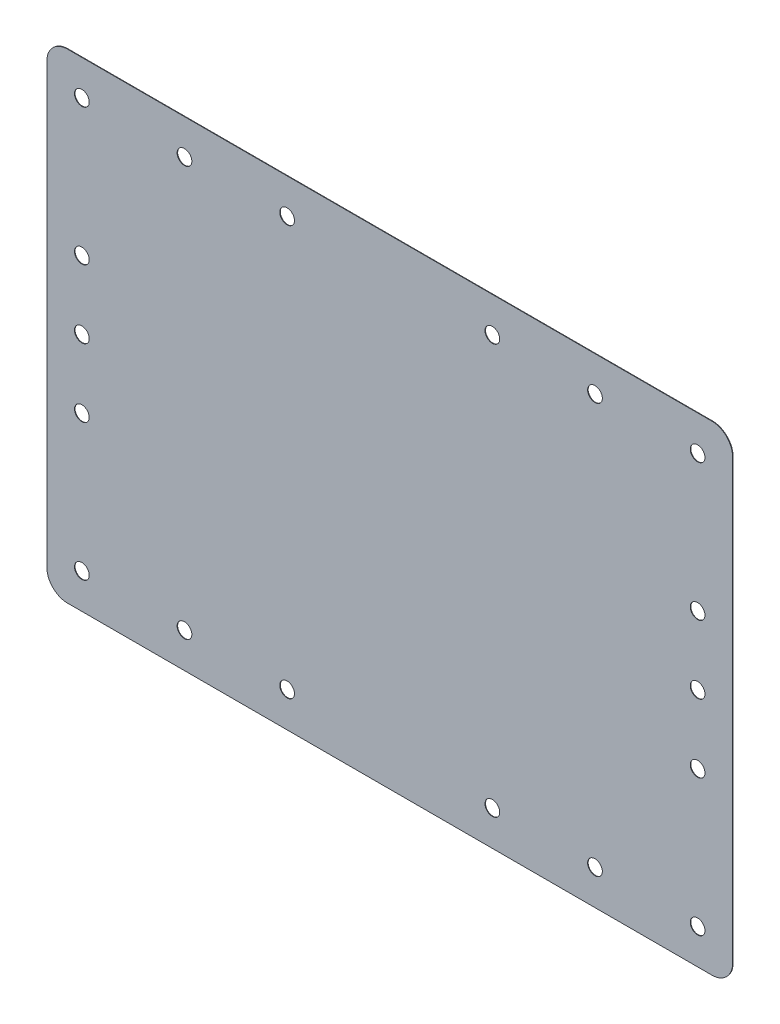
ISO-10303-21;
HEADER;
FILE_DESCRIPTION(('STEP AP214'),'2;1');
FILE_NAME('part.step','',(''),(''),'','','');
FILE_SCHEMA(('AUTOMOTIVE_DESIGN { 1 0 10303 214 1 1 1 1 }'));
ENDSEC;
DATA;
#1=APPLICATION_CONTEXT('core data for automotive mechanical design processes');
#2=APPLICATION_PROTOCOL_DEFINITION('international standard','automotive_design',2000,#1);
#3=PRODUCT_CONTEXT('',#1,'mechanical');
#4=PRODUCT('Part','Part','',(#3));
#5=PRODUCT_RELATED_PRODUCT_CATEGORY('part','',(#4));
#6=PRODUCT_DEFINITION_FORMATION('','',#4);
#7=PRODUCT_DEFINITION_CONTEXT('part definition',#1,'design');
#8=PRODUCT_DEFINITION('design','',#6,#7);
#9=PRODUCT_DEFINITION_SHAPE('','',#8);
#10=(LENGTH_UNIT() NAMED_UNIT(*) SI_UNIT(.MILLI.,.METRE.));
#11=(NAMED_UNIT(*) PLANE_ANGLE_UNIT() SI_UNIT($,.RADIAN.));
#12=(NAMED_UNIT(*) SI_UNIT($,.STERADIAN.) SOLID_ANGLE_UNIT());
#13=UNCERTAINTY_MEASURE_WITH_UNIT(LENGTH_MEASURE(1.E-05),#10,'distance_accuracy_value','');
#14=(GEOMETRIC_REPRESENTATION_CONTEXT(3) GLOBAL_UNCERTAINTY_ASSIGNED_CONTEXT((#13)) GLOBAL_UNIT_ASSIGNED_CONTEXT((#10,
#11,#12)) REPRESENTATION_CONTEXT('',''));
#15=CARTESIAN_POINT('',(0.,0.,0.));
#16=DIRECTION('',(0.,0.,1.));
#17=DIRECTION('',(1.,0.,0.));
#18=AXIS2_PLACEMENT_3D('',#15,#16,#17);
#19=CARTESIAN_POINT('',(82.8071242188,0.,0.127));
#20=DIRECTION('',(-1.,0.,0.));
#21=DIRECTION('',(0.,0.,1.));
#22=AXIS2_PLACEMENT_3D('',#19,#20,#21);
#23=PLANE('',#22);
#24=DIRECTION('',(0.,1.,0.));
#25=VECTOR('',#24,1.);
#26=CARTESIAN_POINT('',(82.8071242188,0.,0.));
#27=LINE('',#26,#25);
#28=CARTESIAN_POINT('',(82.8071242188,-52.938976545,0.));
#29=VERTEX_POINT('',#28);
#30=CARTESIAN_POINT('',(82.8071242188,52.938976545,0.));
#31=VERTEX_POINT('',#30);
#32=EDGE_CURVE('E245',#29,#31,#27,.T.);
#33=ORIENTED_EDGE('',*,*,#32,.T.);
#34=DIRECTION('',(0.,0.,-1.));
#35=VECTOR('',#34,1.);
#36=CARTESIAN_POINT('',(82.8071242188,52.938976545,0.127));
#37=LINE('',#36,#35);
#38=CARTESIAN_POINT('',(82.8071242188,52.938976545,0.127));
#39=VERTEX_POINT('',#38);
#40=EDGE_CURVE('E13',#39,#31,#37,.T.);
#41=ORIENTED_EDGE('',*,*,#40,.F.);
#42=DIRECTION('',(0.,1.,0.));
#43=VECTOR('',#42,1.);
#44=CARTESIAN_POINT('',(82.8071242188,0.,0.127));
#45=LINE('',#44,#43);
#46=CARTESIAN_POINT('',(82.8071242188,-52.938976545,0.127));
#47=VERTEX_POINT('',#46);
#48=EDGE_CURVE('E308',#47,#39,#45,.T.);
#49=ORIENTED_EDGE('',*,*,#48,.F.);
#50=DIRECTION('',(0.,0.,-1.));
#51=VECTOR('',#50,1.);
#52=CARTESIAN_POINT('',(82.8071242188,-52.938976545,0.127));
#53=LINE('',#52,#51);
#54=EDGE_CURVE('E170',#47,#29,#53,.T.);
#55=ORIENTED_EDGE('',*,*,#54,.T.);
#56=EDGE_LOOP('',(#33,#41,#49,#55));
#57=FACE_BOUND('',#56,.T.);
#58=ADVANCED_FACE('F54',(#57),#23,.F.);
#59=CARTESIAN_POINT('',(77.8133207404905,52.9383207404905,0.127));
#60=DIRECTION('',(0.,0.,-1.));
#61=DIRECTION('',(-1.,0.,0.));
#62=AXIS2_PLACEMENT_3D('',#59,#60,#61);
#63=CYLINDRICAL_SURFACE('',#62,4.99380352137079);
#64=CARTESIAN_POINT('',(77.8133207404905,52.9383207404905,0.));
#65=DIRECTION('',(0.,0.,1.));
#66=DIRECTION('',(1.,0.,0.));
#67=AXIS2_PLACEMENT_3D('',#64,#65,#66);
#68=CIRCLE('',#67,4.99380352137079);
#69=CARTESIAN_POINT('',(77.813976545,57.9321242188,0.));
#70=VERTEX_POINT('',#69);
#71=EDGE_CURVE('E249',#31,#70,#68,.T.);
#72=ORIENTED_EDGE('',*,*,#71,.T.);
#73=DIRECTION('',(0.,0.,-1.));
#74=VECTOR('',#73,1.);
#75=CARTESIAN_POINT('',(77.813976545,57.9321242188,0.127));
#76=LINE('',#75,#74);
#77=CARTESIAN_POINT('',(77.813976545,57.9321242188,0.127));
#78=VERTEX_POINT('',#77);
#79=EDGE_CURVE('E64',#78,#70,#76,.T.);
#80=ORIENTED_EDGE('',*,*,#79,.F.);
#81=CARTESIAN_POINT('',(77.8133207404905,52.9383207404905,0.127));
#82=DIRECTION('',(0.,0.,1.));
#83=DIRECTION('',(1.,0.,0.));
#84=AXIS2_PLACEMENT_3D('',#81,#82,#83);
#85=CIRCLE('',#84,4.99380352137079);
#86=EDGE_CURVE('E126',#39,#78,#85,.T.);
#87=ORIENTED_EDGE('',*,*,#86,.F.);
#88=ORIENTED_EDGE('',*,*,#40,.T.);
#89=EDGE_LOOP('',(#72,#80,#87,#88));
#90=FACE_BOUND('',#89,.T.);
#91=ADVANCED_FACE('F438',(#90),#63,.T.);
#92=CARTESIAN_POINT('',(0.,57.9321242188,0.127));
#93=DIRECTION('',(0.,-1.,0.));
#94=DIRECTION('',(0.,0.,-1.));
#95=AXIS2_PLACEMENT_3D('',#92,#93,#94);
#96=PLANE('',#95);
#97=DIRECTION('',(-1.,0.,0.));
#98=VECTOR('',#97,1.);
#99=CARTESIAN_POINT('',(0.,57.9321242188,0.));
#100=LINE('',#99,#98);
#101=CARTESIAN_POINT('',(-77.813976545,57.9321242188,0.));
#102=VERTEX_POINT('',#101);
#103=EDGE_CURVE('E252',#70,#102,#100,.T.);
#104=ORIENTED_EDGE('',*,*,#103,.T.);
#105=DIRECTION('',(0.,0.,-1.));
#106=VECTOR('',#105,1.);
#107=CARTESIAN_POINT('',(-77.813976545,57.9321242188,0.127));
#108=LINE('',#107,#106);
#109=CARTESIAN_POINT('',(-77.813976545,57.9321242188,0.127));
#110=VERTEX_POINT('',#109);
#111=EDGE_CURVE('E277',#110,#102,#108,.T.);
#112=ORIENTED_EDGE('',*,*,#111,.F.);
#113=DIRECTION('',(-1.,0.,0.));
#114=VECTOR('',#113,1.);
#115=CARTESIAN_POINT('',(0.,57.9321242188,0.127));
#116=LINE('',#115,#114);
#117=EDGE_CURVE('E287',#78,#110,#116,.T.);
#118=ORIENTED_EDGE('',*,*,#117,.F.);
#119=ORIENTED_EDGE('',*,*,#79,.T.);
#120=EDGE_LOOP('',(#104,#112,#118,#119));
#121=FACE_BOUND('',#120,.T.);
#122=ADVANCED_FACE('F285',(#121),#96,.F.);
#123=CARTESIAN_POINT('',(-77.8133207404905,52.9383207404905,0.127));
#124=DIRECTION('',(0.,0.,-1.));
#125=DIRECTION('',(-1.,0.,0.));
#126=AXIS2_PLACEMENT_3D('',#123,#124,#125);
#127=CYLINDRICAL_SURFACE('',#126,4.99380352137079);
#128=CARTESIAN_POINT('',(-77.8133207404905,52.9383207404905,0.));
#129=DIRECTION('',(0.,0.,1.));
#130=DIRECTION('',(1.,0.,0.));
#131=AXIS2_PLACEMENT_3D('',#128,#129,#130);
#132=CIRCLE('',#131,4.99380352137079);
#133=CARTESIAN_POINT('',(-82.8071242188,52.938976545,0.));
#134=VERTEX_POINT('',#133);
#135=EDGE_CURVE('E255',#102,#134,#132,.T.);
#136=ORIENTED_EDGE('',*,*,#135,.T.);
#137=DIRECTION('',(0.,0.,-1.));
#138=VECTOR('',#137,1.);
#139=CARTESIAN_POINT('',(-82.8071242188,52.938976545,0.127));
#140=LINE('',#139,#138);
#141=CARTESIAN_POINT('',(-82.8071242188,52.938976545,0.127));
#142=VERTEX_POINT('',#141);
#143=EDGE_CURVE('E273',#142,#134,#140,.T.);
#144=ORIENTED_EDGE('',*,*,#143,.F.);
#145=CARTESIAN_POINT('',(-77.8133207404905,52.9383207404905,0.127));
#146=DIRECTION('',(0.,0.,1.));
#147=DIRECTION('',(1.,0.,0.));
#148=AXIS2_PLACEMENT_3D('',#145,#146,#147);
#149=CIRCLE('',#148,4.99380352137079);
#150=EDGE_CURVE('E300',#110,#142,#149,.T.);
#151=ORIENTED_EDGE('',*,*,#150,.F.);
#152=ORIENTED_EDGE('',*,*,#111,.T.);
#153=EDGE_LOOP('',(#136,#144,#151,#152));
#154=FACE_BOUND('',#153,.T.);
#155=ADVANCED_FACE('F295',(#154),#127,.T.);
#156=CARTESIAN_POINT('',(-82.8071242188,0.,0.127));
#157=DIRECTION('',(1.,0.,0.));
#158=DIRECTION('',(0.,0.,-1.));
#159=AXIS2_PLACEMENT_3D('',#156,#157,#158);
#160=PLANE('',#159);
#161=DIRECTION('',(0.,-1.,0.));
#162=VECTOR('',#161,1.);
#163=CARTESIAN_POINT('',(-82.8071242188,0.,0.));
#164=LINE('',#163,#162);
#165=CARTESIAN_POINT('',(-82.8071242188,-52.938976545,0.));
#166=VERTEX_POINT('',#165);
#167=EDGE_CURVE('E258',#134,#166,#164,.T.);
#168=ORIENTED_EDGE('',*,*,#167,.T.);
#169=DIRECTION('',(0.,0.,-1.));
#170=VECTOR('',#169,1.);
#171=CARTESIAN_POINT('',(-82.8071242188,-52.938976545,0.127));
#172=LINE('',#171,#170);
#173=CARTESIAN_POINT('',(-82.8071242188,-52.938976545,0.127));
#174=VERTEX_POINT('',#173);
#175=EDGE_CURVE('E161',#174,#166,#172,.T.);
#176=ORIENTED_EDGE('',*,*,#175,.F.);
#177=DIRECTION('',(0.,-1.,0.));
#178=VECTOR('',#177,1.);
#179=CARTESIAN_POINT('',(-82.8071242188,0.,0.127));
#180=LINE('',#179,#178);
#181=EDGE_CURVE('E150',#142,#174,#180,.T.);
#182=ORIENTED_EDGE('',*,*,#181,.F.);
#183=ORIENTED_EDGE('',*,*,#143,.T.);
#184=EDGE_LOOP('',(#168,#176,#182,#183));
#185=FACE_BOUND('',#184,.T.);
#186=ADVANCED_FACE('F298',(#185),#160,.F.);
#187=CARTESIAN_POINT('',(-77.8133207404906,-52.9383207404905,0.127));
#188=DIRECTION('',(0.,0.,-1.));
#189=DIRECTION('',(-1.,0.,0.));
#190=AXIS2_PLACEMENT_3D('',#187,#188,#189);
#191=CYLINDRICAL_SURFACE('',#190,4.99380352137078);
#192=CARTESIAN_POINT('',(-77.8133207404906,-52.9383207404905,0.));
#193=DIRECTION('',(0.,0.,1.));
#194=DIRECTION('',(1.,0.,0.));
#195=AXIS2_PLACEMENT_3D('',#192,#193,#194);
#196=CIRCLE('',#195,4.99380352137078);
#197=CARTESIAN_POINT('',(-77.813976545,-57.9321242188,0.));
#198=VERTEX_POINT('',#197);
#199=EDGE_CURVE('E159',#166,#198,#196,.T.);
#200=ORIENTED_EDGE('',*,*,#199,.T.);
#201=DIRECTION('',(0.,0.,-1.));
#202=VECTOR('',#201,1.);
#203=CARTESIAN_POINT('',(-77.813976545,-57.9321242188,0.127));
#204=LINE('',#203,#202);
#205=CARTESIAN_POINT('',(-77.813976545,-57.9321242188,0.127));
#206=VERTEX_POINT('',#205);
#207=EDGE_CURVE('E156',#206,#198,#204,.T.);
#208=ORIENTED_EDGE('',*,*,#207,.F.);
#209=CARTESIAN_POINT('',(-77.8133207404906,-52.9383207404905,0.127));
#210=DIRECTION('',(0.,0.,1.));
#211=DIRECTION('',(1.,0.,0.));
#212=AXIS2_PLACEMENT_3D('',#209,#210,#211);
#213=CIRCLE('',#212,4.99380352137078);
#214=EDGE_CURVE('E144',#174,#206,#213,.T.);
#215=ORIENTED_EDGE('',*,*,#214,.F.);
#216=ORIENTED_EDGE('',*,*,#175,.T.);
#217=EDGE_LOOP('',(#200,#208,#215,#216));
#218=FACE_BOUND('',#217,.T.);
#219=ADVANCED_FACE('F157',(#218),#191,.T.);
#220=CARTESIAN_POINT('',(0.,-57.9321242188,0.127));
#221=DIRECTION('',(0.,1.,0.));
#222=DIRECTION('',(0.,0.,1.));
#223=AXIS2_PLACEMENT_3D('',#220,#221,#222);
#224=PLANE('',#223);
#225=DIRECTION('',(1.,0.,0.));
#226=VECTOR('',#225,1.);
#227=CARTESIAN_POINT('',(0.,-57.9321242188,0.));
#228=LINE('',#227,#226);
#229=CARTESIAN_POINT('',(77.813976545,-57.9321242188,0.));
#230=VERTEX_POINT('',#229);
#231=EDGE_CURVE('E111',#198,#230,#228,.T.);
#232=ORIENTED_EDGE('',*,*,#231,.T.);
#233=DIRECTION('',(0.,0.,-1.));
#234=VECTOR('',#233,1.);
#235=CARTESIAN_POINT('',(77.813976545,-57.9321242188,0.127));
#236=LINE('',#235,#234);
#237=CARTESIAN_POINT('',(77.813976545,-57.9321242188,0.127));
#238=VERTEX_POINT('',#237);
#239=EDGE_CURVE('E162',#238,#230,#236,.T.);
#240=ORIENTED_EDGE('',*,*,#239,.F.);
#241=DIRECTION('',(1.,0.,0.));
#242=VECTOR('',#241,1.);
#243=CARTESIAN_POINT('',(0.,-57.9321242188,0.127));
#244=LINE('',#243,#242);
#245=EDGE_CURVE('E148',#206,#238,#244,.T.);
#246=ORIENTED_EDGE('',*,*,#245,.F.);
#247=ORIENTED_EDGE('',*,*,#207,.T.);
#248=EDGE_LOOP('',(#232,#240,#246,#247));
#249=FACE_BOUND('',#248,.T.);
#250=ADVANCED_FACE('F164',(#249),#224,.F.);
#251=CARTESIAN_POINT('',(74.3480423595,0.,0.127));
#252=DIRECTION('',(0.,0.,-1.));
#253=DIRECTION('',(-1.,0.,0.));
#254=AXIS2_PLACEMENT_3D('',#251,#252,#253);
#255=CYLINDRICAL_SURFACE('',#254,1.77500000000003);
#256=CARTESIAN_POINT('',(74.3480423595,0.,0.127));
#257=DIRECTION('',(0.,0.,1.));
#258=DIRECTION('',(1.,0.,0.));
#259=AXIS2_PLACEMENT_3D('',#256,#257,#258);
#260=CIRCLE('',#259,1.77500000000003);
#261=CARTESIAN_POINT('',(76.1230423595,0.,0.127));
#262=VERTEX_POINT('',#261);
#263=EDGE_CURVE('E311',#262,#262,#260,.T.);
#264=ORIENTED_EDGE('',*,*,#263,.T.);
#265=EDGE_LOOP('',(#264));
#266=FACE_BOUND('',#265,.T.);
#267=CARTESIAN_POINT('',(74.3480423595,0.,0.));
#268=DIRECTION('',(0.,0.,1.));
#269=DIRECTION('',(1.,0.,0.));
#270=AXIS2_PLACEMENT_3D('',#267,#268,#269);
#271=CIRCLE('',#270,1.77500000000003);
#272=CARTESIAN_POINT('',(76.1230423595,0.,0.));
#273=VERTEX_POINT('',#272);
#274=EDGE_CURVE('E241',#273,#273,#271,.T.);
#275=ORIENTED_EDGE('',*,*,#274,.F.);
#276=EDGE_LOOP('',(#275));
#277=FACE_BOUND('',#276,.T.);
#278=ADVANCED_FACE('F423',(#266,#277),#255,.F.);
#279=CARTESIAN_POINT('',(-74.3480423595,0.,0.127));
#280=DIRECTION('',(0.,0.,-1.));
#281=DIRECTION('',(-1.,0.,0.));
#282=AXIS2_PLACEMENT_3D('',#279,#280,#281);
#283=CYLINDRICAL_SURFACE('',#282,1.77499999999998);
#284=CARTESIAN_POINT('',(-74.3480423595,0.,0.127));
#285=DIRECTION('',(0.,0.,1.));
#286=DIRECTION('',(1.,0.,0.));
#287=AXIS2_PLACEMENT_3D('',#284,#285,#286);
#288=CIRCLE('',#287,1.77499999999998);
#289=CARTESIAN_POINT('',(-72.5730423595,0.,0.127));
#290=VERTEX_POINT('',#289);
#291=EDGE_CURVE('E315',#290,#290,#288,.T.);
#292=ORIENTED_EDGE('',*,*,#291,.T.);
#293=EDGE_LOOP('',(#292));
#294=FACE_BOUND('',#293,.T.);
#295=CARTESIAN_POINT('',(-74.3480423595,0.,0.));
#296=DIRECTION('',(0.,0.,1.));
#297=DIRECTION('',(1.,0.,0.));
#298=AXIS2_PLACEMENT_3D('',#295,#296,#297);
#299=CIRCLE('',#298,1.77499999999998);
#300=CARTESIAN_POINT('',(-72.5730423595,0.,0.));
#301=VERTEX_POINT('',#300);
#302=EDGE_CURVE('E237',#301,#301,#299,.T.);
#303=ORIENTED_EDGE('',*,*,#302,.F.);
#304=EDGE_LOOP('',(#303));
#305=FACE_BOUND('',#304,.T.);
#306=ADVANCED_FACE('F426',(#294,#305),#283,.F.);
#307=CARTESIAN_POINT('',(49.565361573,49.4730423595,0.127));
#308=DIRECTION('',(0.,0.,-1.));
#309=DIRECTION('',(-1.,0.,0.));
#310=AXIS2_PLACEMENT_3D('',#307,#308,#309);
#311=CYLINDRICAL_SURFACE('',#310,1.77499999999998);
#312=CARTESIAN_POINT('',(49.565361573,49.4730423595,0.127));
#313=DIRECTION('',(0.,0.,1.));
#314=DIRECTION('',(1.,0.,0.));
#315=AXIS2_PLACEMENT_3D('',#312,#313,#314);
#316=CIRCLE('',#315,1.77499999999998);
#317=CARTESIAN_POINT('',(51.340361573,49.4730423595,0.127));
#318=VERTEX_POINT('',#317);
#319=EDGE_CURVE('E319',#318,#318,#316,.T.);
#320=ORIENTED_EDGE('',*,*,#319,.T.);
#321=EDGE_LOOP('',(#320));
#322=FACE_BOUND('',#321,.T.);
#323=CARTESIAN_POINT('',(49.565361573,49.4730423595,0.));
#324=DIRECTION('',(0.,0.,1.));
#325=DIRECTION('',(1.,0.,0.));
#326=AXIS2_PLACEMENT_3D('',#323,#324,#325);
#327=CIRCLE('',#326,1.77499999999998);
#328=CARTESIAN_POINT('',(51.340361573,49.4730423595,0.));
#329=VERTEX_POINT('',#328);
#330=EDGE_CURVE('E233',#329,#329,#327,.T.);
#331=ORIENTED_EDGE('',*,*,#330,.F.);
#332=EDGE_LOOP('',(#331));
#333=FACE_BOUND('',#332,.T.);
#334=ADVANCED_FACE('F449',(#322,#333),#311,.F.);
#335=CARTESIAN_POINT('',(-49.565361573,49.4730423595,0.127));
#336=DIRECTION('',(0.,0.,-1.));
#337=DIRECTION('',(-1.,0.,0.));
#338=AXIS2_PLACEMENT_3D('',#335,#336,#337);
#339=CYLINDRICAL_SURFACE('',#338,1.77499999999998);
#340=CARTESIAN_POINT('',(-49.565361573,49.4730423595,0.127));
#341=DIRECTION('',(0.,0.,1.));
#342=DIRECTION('',(1.,0.,0.));
#343=AXIS2_PLACEMENT_3D('',#340,#341,#342);
#344=CIRCLE('',#343,1.77499999999998);
#345=CARTESIAN_POINT('',(-47.790361573,49.4730423595,0.127));
#346=VERTEX_POINT('',#345);
#347=EDGE_CURVE('E323',#346,#346,#344,.T.);
#348=ORIENTED_EDGE('',*,*,#347,.T.);
#349=EDGE_LOOP('',(#348));
#350=FACE_BOUND('',#349,.T.);
#351=CARTESIAN_POINT('',(-49.565361573,49.4730423595,0.));
#352=DIRECTION('',(0.,0.,1.));
#353=DIRECTION('',(1.,0.,0.));
#354=AXIS2_PLACEMENT_3D('',#351,#352,#353);
#355=CIRCLE('',#354,1.77499999999998);
#356=CARTESIAN_POINT('',(-47.790361573,49.4730423595,0.));
#357=VERTEX_POINT('',#356);
#358=EDGE_CURVE('E229',#357,#357,#355,.T.);
#359=ORIENTED_EDGE('',*,*,#358,.F.);
#360=EDGE_LOOP('',(#359));
#361=FACE_BOUND('',#360,.T.);
#362=ADVANCED_FACE('F453',(#350,#361),#339,.F.);
#363=CARTESIAN_POINT('',(-49.565361573,-49.4730423595,0.127));
#364=DIRECTION('',(0.,0.,-1.));
#365=DIRECTION('',(-1.,0.,0.));
#366=AXIS2_PLACEMENT_3D('',#363,#364,#365);
#367=CYLINDRICAL_SURFACE('',#366,1.775);
#368=CARTESIAN_POINT('',(-49.565361573,-49.4730423595,0.127));
#369=DIRECTION('',(0.,0.,1.));
#370=DIRECTION('',(1.,0.,0.));
#371=AXIS2_PLACEMENT_3D('',#368,#369,#370);
#372=CIRCLE('',#371,1.775);
#373=CARTESIAN_POINT('',(-47.790361573,-49.4730423595,0.127));
#374=VERTEX_POINT('',#373);
#375=EDGE_CURVE('E327',#374,#374,#372,.T.);
#376=ORIENTED_EDGE('',*,*,#375,.T.);
#377=EDGE_LOOP('',(#376));
#378=FACE_BOUND('',#377,.T.);
#379=CARTESIAN_POINT('',(-49.565361573,-49.4730423595,0.));
#380=DIRECTION('',(0.,0.,1.));
#381=DIRECTION('',(1.,0.,0.));
#382=AXIS2_PLACEMENT_3D('',#379,#380,#381);
#383=CIRCLE('',#382,1.775);
#384=CARTESIAN_POINT('',(-47.790361573,-49.4730423595,0.));
#385=VERTEX_POINT('',#384);
#386=EDGE_CURVE('E225',#385,#385,#383,.T.);
#387=ORIENTED_EDGE('',*,*,#386,.F.);
#388=EDGE_LOOP('',(#387));
#389=FACE_BOUND('',#388,.T.);
#390=ADVANCED_FACE('F457',(#378,#389),#367,.F.);
#391=CARTESIAN_POINT('',(49.565361573,-49.4730423595,0.127));
#392=DIRECTION('',(0.,0.,-1.));
#393=DIRECTION('',(-1.,0.,0.));
#394=AXIS2_PLACEMENT_3D('',#391,#392,#393);
#395=CYLINDRICAL_SURFACE('',#394,1.775);
#396=CARTESIAN_POINT('',(49.565361573,-49.4730423595,0.127));
#397=DIRECTION('',(0.,0.,1.));
#398=DIRECTION('',(1.,0.,0.));
#399=AXIS2_PLACEMENT_3D('',#396,#397,#398);
#400=CIRCLE('',#399,1.775);
#401=CARTESIAN_POINT('',(51.340361573,-49.4730423595,0.127));
#402=VERTEX_POINT('',#401);
#403=EDGE_CURVE('E331',#402,#402,#400,.T.);
#404=ORIENTED_EDGE('',*,*,#403,.T.);
#405=EDGE_LOOP('',(#404));
#406=FACE_BOUND('',#405,.T.);
#407=CARTESIAN_POINT('',(49.565361573,-49.4730423595,0.));
#408=DIRECTION('',(0.,0.,1.));
#409=DIRECTION('',(1.,0.,0.));
#410=AXIS2_PLACEMENT_3D('',#407,#408,#409);
#411=CIRCLE('',#410,1.775);
#412=CARTESIAN_POINT('',(51.340361573,-49.4730423595,0.));
#413=VERTEX_POINT('',#412);
#414=EDGE_CURVE('E221',#413,#413,#411,.T.);
#415=ORIENTED_EDGE('',*,*,#414,.F.);
#416=EDGE_LOOP('',(#415));
#417=FACE_BOUND('',#416,.T.);
#418=ADVANCED_FACE('F461',(#406,#417),#395,.F.);
#419=CARTESIAN_POINT('',(-74.3480423595,16.4910141198,0.127));
#420=DIRECTION('',(0.,0.,-1.));
#421=DIRECTION('',(-1.,0.,0.));
#422=AXIS2_PLACEMENT_3D('',#419,#420,#421);
#423=CYLINDRICAL_SURFACE('',#422,1.77499999999998);
#424=CARTESIAN_POINT('',(-74.3480423595,16.4910141198,0.127));
#425=DIRECTION('',(0.,0.,1.));
#426=DIRECTION('',(1.,0.,0.));
#427=AXIS2_PLACEMENT_3D('',#424,#425,#426);
#428=CIRCLE('',#427,1.77499999999998);
#429=CARTESIAN_POINT('',(-72.5730423595,16.4910141198,0.127));
#430=VERTEX_POINT('',#429);
#431=EDGE_CURVE('E335',#430,#430,#428,.T.);
#432=ORIENTED_EDGE('',*,*,#431,.T.);
#433=EDGE_LOOP('',(#432));
#434=FACE_BOUND('',#433,.T.);
#435=CARTESIAN_POINT('',(-74.3480423595,16.4910141198,0.));
#436=DIRECTION('',(0.,0.,1.));
#437=DIRECTION('',(1.,0.,0.));
#438=AXIS2_PLACEMENT_3D('',#435,#436,#437);
#439=CIRCLE('',#438,1.77499999999998);
#440=CARTESIAN_POINT('',(-72.5730423595,16.4910141198,0.));
#441=VERTEX_POINT('',#440);
#442=EDGE_CURVE('E217',#441,#441,#439,.T.);
#443=ORIENTED_EDGE('',*,*,#442,.F.);
#444=EDGE_LOOP('',(#443));
#445=FACE_BOUND('',#444,.T.);
#446=ADVANCED_FACE('F465',(#434,#445),#423,.F.);
#447=CARTESIAN_POINT('',(-74.3480423595,-16.4910141198,0.127));
#448=DIRECTION('',(0.,0.,-1.));
#449=DIRECTION('',(-1.,0.,0.));
#450=AXIS2_PLACEMENT_3D('',#447,#448,#449);
#451=CYLINDRICAL_SURFACE('',#450,1.77499999999998);
#452=CARTESIAN_POINT('',(-74.3480423595,-16.4910141198,0.127));
#453=DIRECTION('',(0.,0.,1.));
#454=DIRECTION('',(1.,0.,0.));
#455=AXIS2_PLACEMENT_3D('',#452,#453,#454);
#456=CIRCLE('',#455,1.77499999999998);
#457=CARTESIAN_POINT('',(-72.5730423595,-16.4910141198,0.127));
#458=VERTEX_POINT('',#457);
#459=EDGE_CURVE('E339',#458,#458,#456,.T.);
#460=ORIENTED_EDGE('',*,*,#459,.T.);
#461=EDGE_LOOP('',(#460));
#462=FACE_BOUND('',#461,.T.);
#463=CARTESIAN_POINT('',(-74.3480423595,-16.4910141198,0.));
#464=DIRECTION('',(0.,0.,1.));
#465=DIRECTION('',(1.,0.,0.));
#466=AXIS2_PLACEMENT_3D('',#463,#464,#465);
#467=CIRCLE('',#466,1.77499999999998);
#468=CARTESIAN_POINT('',(-72.5730423595,-16.4910141198,0.));
#469=VERTEX_POINT('',#468);
#470=EDGE_CURVE('E213',#469,#469,#467,.T.);
#471=ORIENTED_EDGE('',*,*,#470,.F.);
#472=EDGE_LOOP('',(#471));
#473=FACE_BOUND('',#472,.T.);
#474=ADVANCED_FACE('F469',(#462,#473),#451,.F.);
#475=CARTESIAN_POINT('',(-74.3480423595,-49.4730423595,0.127));
#476=DIRECTION('',(0.,0.,-1.));
#477=DIRECTION('',(-1.,0.,0.));
#478=AXIS2_PLACEMENT_3D('',#475,#476,#477);
#479=CYLINDRICAL_SURFACE('',#478,1.77499999999998);
#480=CARTESIAN_POINT('',(-74.3480423595,-49.4730423595,0.127));
#481=DIRECTION('',(0.,0.,1.));
#482=DIRECTION('',(1.,0.,0.));
#483=AXIS2_PLACEMENT_3D('',#480,#481,#482);
#484=CIRCLE('',#483,1.77499999999998);
#485=CARTESIAN_POINT('',(-72.5730423595,-49.4730423595,0.127));
#486=VERTEX_POINT('',#485);
#487=EDGE_CURVE('E343',#486,#486,#484,.T.);
#488=ORIENTED_EDGE('',*,*,#487,.T.);
#489=EDGE_LOOP('',(#488));
#490=FACE_BOUND('',#489,.T.);
#491=CARTESIAN_POINT('',(-74.3480423595,-49.4730423595,0.));
#492=DIRECTION('',(0.,0.,1.));
#493=DIRECTION('',(1.,0.,0.));
#494=AXIS2_PLACEMENT_3D('',#491,#492,#493);
#495=CIRCLE('',#494,1.77499999999998);
#496=CARTESIAN_POINT('',(-72.5730423595,-49.4730423595,0.));
#497=VERTEX_POINT('',#496);
#498=EDGE_CURVE('E209',#497,#497,#495,.T.);
#499=ORIENTED_EDGE('',*,*,#498,.F.);
#500=EDGE_LOOP('',(#499));
#501=FACE_BOUND('',#500,.T.);
#502=ADVANCED_FACE('F473',(#490,#501),#479,.F.);
#503=CARTESIAN_POINT('',(-24.7826807865,-49.4730423595,0.127));
#504=DIRECTION('',(0.,0.,-1.));
#505=DIRECTION('',(-1.,0.,0.));
#506=AXIS2_PLACEMENT_3D('',#503,#504,#505);
#507=CYLINDRICAL_SURFACE('',#506,1.775);
#508=CARTESIAN_POINT('',(-24.7826807865,-49.4730423595,0.127));
#509=DIRECTION('',(0.,0.,1.));
#510=DIRECTION('',(1.,0.,0.));
#511=AXIS2_PLACEMENT_3D('',#508,#509,#510);
#512=CIRCLE('',#511,1.775);
#513=CARTESIAN_POINT('',(-23.0076807865,-49.4730423595,0.127));
#514=VERTEX_POINT('',#513);
#515=EDGE_CURVE('E347',#514,#514,#512,.T.);
#516=ORIENTED_EDGE('',*,*,#515,.T.);
#517=EDGE_LOOP('',(#516));
#518=FACE_BOUND('',#517,.T.);
#519=CARTESIAN_POINT('',(-24.7826807865,-49.4730423595,0.));
#520=DIRECTION('',(0.,0.,1.));
#521=DIRECTION('',(1.,0.,0.));
#522=AXIS2_PLACEMENT_3D('',#519,#520,#521);
#523=CIRCLE('',#522,1.775);
#524=CARTESIAN_POINT('',(-23.0076807865,-49.4730423595,0.));
#525=VERTEX_POINT('',#524);
#526=EDGE_CURVE('E205',#525,#525,#523,.T.);
#527=ORIENTED_EDGE('',*,*,#526,.F.);
#528=EDGE_LOOP('',(#527));
#529=FACE_BOUND('',#528,.T.);
#530=ADVANCED_FACE('F477',(#518,#529),#507,.F.);
#531=CARTESIAN_POINT('',(24.7826807865,-49.4730423595,0.127));
#532=DIRECTION('',(0.,0.,-1.));
#533=DIRECTION('',(-1.,0.,0.));
#534=AXIS2_PLACEMENT_3D('',#531,#532,#533);
#535=CYLINDRICAL_SURFACE('',#534,1.77500000000001);
#536=CARTESIAN_POINT('',(24.7826807865,-49.4730423595,0.127));
#537=DIRECTION('',(0.,0.,1.));
#538=DIRECTION('',(1.,0.,0.));
#539=AXIS2_PLACEMENT_3D('',#536,#537,#538);
#540=CIRCLE('',#539,1.77500000000001);
#541=CARTESIAN_POINT('',(26.5576807865,-49.4730423595,0.127));
#542=VERTEX_POINT('',#541);
#543=EDGE_CURVE('E351',#542,#542,#540,.T.);
#544=ORIENTED_EDGE('',*,*,#543,.T.);
#545=EDGE_LOOP('',(#544));
#546=FACE_BOUND('',#545,.T.);
#547=CARTESIAN_POINT('',(24.7826807865,-49.4730423595,0.));
#548=DIRECTION('',(0.,0.,1.));
#549=DIRECTION('',(1.,0.,0.));
#550=AXIS2_PLACEMENT_3D('',#547,#548,#549);
#551=CIRCLE('',#550,1.77500000000001);
#552=CARTESIAN_POINT('',(26.5576807865,-49.4730423595,0.));
#553=VERTEX_POINT('',#552);
#554=EDGE_CURVE('E201',#553,#553,#551,.T.);
#555=ORIENTED_EDGE('',*,*,#554,.F.);
#556=EDGE_LOOP('',(#555));
#557=FACE_BOUND('',#556,.T.);
#558=ADVANCED_FACE('F481',(#546,#557),#535,.F.);
#559=CARTESIAN_POINT('',(74.3480423595,-49.4730423595,0.127));
#560=DIRECTION('',(0.,0.,-1.));
#561=DIRECTION('',(-1.,0.,0.));
#562=AXIS2_PLACEMENT_3D('',#559,#560,#561);
#563=CYLINDRICAL_SURFACE('',#562,1.77500000000003);
#564=CARTESIAN_POINT('',(74.3480423595,-49.4730423595,0.127));
#565=DIRECTION('',(0.,0.,1.));
#566=DIRECTION('',(1.,0.,0.));
#567=AXIS2_PLACEMENT_3D('',#564,#565,#566);
#568=CIRCLE('',#567,1.77500000000003);
#569=CARTESIAN_POINT('',(76.1230423595,-49.4730423595,0.127));
#570=VERTEX_POINT('',#569);
#571=EDGE_CURVE('E355',#570,#570,#568,.T.);
#572=ORIENTED_EDGE('',*,*,#571,.T.);
#573=EDGE_LOOP('',(#572));
#574=FACE_BOUND('',#573,.T.);
#575=CARTESIAN_POINT('',(74.3480423595,-49.4730423595,0.));
#576=DIRECTION('',(0.,0.,1.));
#577=DIRECTION('',(1.,0.,0.));
#578=AXIS2_PLACEMENT_3D('',#575,#576,#577);
#579=CIRCLE('',#578,1.77500000000003);
#580=CARTESIAN_POINT('',(76.1230423595,-49.4730423595,0.));
#581=VERTEX_POINT('',#580);
#582=EDGE_CURVE('E198',#581,#581,#579,.T.);
#583=ORIENTED_EDGE('',*,*,#582,.F.);
#584=EDGE_LOOP('',(#583));
#585=FACE_BOUND('',#584,.T.);
#586=ADVANCED_FACE('F485',(#574,#585),#563,.F.);
#587=CARTESIAN_POINT('',(74.3480423595,-16.4910141198,0.127));
#588=DIRECTION('',(0.,0.,-1.));
#589=DIRECTION('',(-1.,0.,0.));
#590=AXIS2_PLACEMENT_3D('',#587,#588,#589);
#591=CYLINDRICAL_SURFACE('',#590,1.77500000000003);
#592=CARTESIAN_POINT('',(74.3480423595,-16.4910141198,0.127));
#593=DIRECTION('',(0.,0.,1.));
#594=DIRECTION('',(1.,0.,0.));
#595=AXIS2_PLACEMENT_3D('',#592,#593,#594);
#596=CIRCLE('',#595,1.77500000000003);
#597=CARTESIAN_POINT('',(76.1230423595,-16.4910141198,0.127));
#598=VERTEX_POINT('',#597);
#599=EDGE_CURVE('E359',#598,#598,#596,.T.);
#600=ORIENTED_EDGE('',*,*,#599,.T.);
#601=EDGE_LOOP('',(#600));
#602=FACE_BOUND('',#601,.T.);
#603=CARTESIAN_POINT('',(74.3480423595,-16.4910141198,0.));
#604=DIRECTION('',(0.,0.,1.));
#605=DIRECTION('',(1.,0.,0.));
#606=AXIS2_PLACEMENT_3D('',#603,#604,#605);
#607=CIRCLE('',#606,1.77500000000003);
#608=CARTESIAN_POINT('',(76.1230423595,-16.4910141198,0.));
#609=VERTEX_POINT('',#608);
#610=EDGE_CURVE('E194',#609,#609,#607,.T.);
#611=ORIENTED_EDGE('',*,*,#610,.F.);
#612=EDGE_LOOP('',(#611));
#613=FACE_BOUND('',#612,.T.);
#614=ADVANCED_FACE('F489',(#602,#613),#591,.F.);
#615=CARTESIAN_POINT('',(74.3480423595,16.4910141198,0.127));
#616=DIRECTION('',(0.,0.,-1.));
#617=DIRECTION('',(-1.,0.,0.));
#618=AXIS2_PLACEMENT_3D('',#615,#616,#617);
#619=CYLINDRICAL_SURFACE('',#618,1.77500000000003);
#620=CARTESIAN_POINT('',(74.3480423595,16.4910141198,0.127));
#621=DIRECTION('',(0.,0.,1.));
#622=DIRECTION('',(1.,0.,0.));
#623=AXIS2_PLACEMENT_3D('',#620,#621,#622);
#624=CIRCLE('',#623,1.77500000000003);
#625=CARTESIAN_POINT('',(76.1230423595,16.4910141198,0.127));
#626=VERTEX_POINT('',#625);
#627=EDGE_CURVE('E363',#626,#626,#624,.T.);
#628=ORIENTED_EDGE('',*,*,#627,.T.);
#629=EDGE_LOOP('',(#628));
#630=FACE_BOUND('',#629,.T.);
#631=CARTESIAN_POINT('',(74.3480423595,16.4910141198,0.));
#632=DIRECTION('',(0.,0.,1.));
#633=DIRECTION('',(1.,0.,0.));
#634=AXIS2_PLACEMENT_3D('',#631,#632,#633);
#635=CIRCLE('',#634,1.77500000000003);
#636=CARTESIAN_POINT('',(76.1230423595,16.4910141198,0.));
#637=VERTEX_POINT('',#636);
#638=EDGE_CURVE('E190',#637,#637,#635,.T.);
#639=ORIENTED_EDGE('',*,*,#638,.F.);
#640=EDGE_LOOP('',(#639));
#641=FACE_BOUND('',#640,.T.);
#642=ADVANCED_FACE('F493',(#630,#641),#619,.F.);
#643=CARTESIAN_POINT('',(74.3480423595,49.4730423595,0.127));
#644=DIRECTION('',(0.,0.,-1.));
#645=DIRECTION('',(-1.,0.,0.));
#646=AXIS2_PLACEMENT_3D('',#643,#644,#645);
#647=CYLINDRICAL_SURFACE('',#646,1.77499999999998);
#648=CARTESIAN_POINT('',(74.3480423595,49.4730423595,0.127));
#649=DIRECTION('',(0.,0.,1.));
#650=DIRECTION('',(1.,0.,0.));
#651=AXIS2_PLACEMENT_3D('',#648,#649,#650);
#652=CIRCLE('',#651,1.77499999999998);
#653=CARTESIAN_POINT('',(76.1230423595,49.4730423595,0.127));
#654=VERTEX_POINT('',#653);
#655=EDGE_CURVE('E367',#654,#654,#652,.T.);
#656=ORIENTED_EDGE('',*,*,#655,.T.);
#657=EDGE_LOOP('',(#656));
#658=FACE_BOUND('',#657,.T.);
#659=CARTESIAN_POINT('',(74.3480423595,49.4730423595,0.));
#660=DIRECTION('',(0.,0.,1.));
#661=DIRECTION('',(1.,0.,0.));
#662=AXIS2_PLACEMENT_3D('',#659,#660,#661);
#663=CIRCLE('',#662,1.77499999999998);
#664=CARTESIAN_POINT('',(76.1230423595,49.4730423595,0.));
#665=VERTEX_POINT('',#664);
#666=EDGE_CURVE('E186',#665,#665,#663,.T.);
#667=ORIENTED_EDGE('',*,*,#666,.F.);
#668=EDGE_LOOP('',(#667));
#669=FACE_BOUND('',#668,.T.);
#670=ADVANCED_FACE('F497',(#658,#669),#647,.F.);
#671=CARTESIAN_POINT('',(24.7826807865,49.4730423595,0.127));
#672=DIRECTION('',(0.,0.,-1.));
#673=DIRECTION('',(-1.,0.,0.));
#674=AXIS2_PLACEMENT_3D('',#671,#672,#673);
#675=CYLINDRICAL_SURFACE('',#674,1.77499999999999);
#676=CARTESIAN_POINT('',(24.7826807865,49.4730423595,0.127));
#677=DIRECTION('',(0.,0.,1.));
#678=DIRECTION('',(1.,0.,0.));
#679=AXIS2_PLACEMENT_3D('',#676,#677,#678);
#680=CIRCLE('',#679,1.77499999999999);
#681=CARTESIAN_POINT('',(26.5576807865,49.4730423595,0.127));
#682=VERTEX_POINT('',#681);
#683=EDGE_CURVE('E371',#682,#682,#680,.T.);
#684=ORIENTED_EDGE('',*,*,#683,.T.);
#685=EDGE_LOOP('',(#684));
#686=FACE_BOUND('',#685,.T.);
#687=CARTESIAN_POINT('',(24.7826807865,49.4730423595,0.));
#688=DIRECTION('',(0.,0.,1.));
#689=DIRECTION('',(1.,0.,0.));
#690=AXIS2_PLACEMENT_3D('',#687,#688,#689);
#691=CIRCLE('',#690,1.77499999999999);
#692=CARTESIAN_POINT('',(26.5576807865,49.4730423595,0.));
#693=VERTEX_POINT('',#692);
#694=EDGE_CURVE('E182',#693,#693,#691,.T.);
#695=ORIENTED_EDGE('',*,*,#694,.F.);
#696=EDGE_LOOP('',(#695));
#697=FACE_BOUND('',#696,.T.);
#698=ADVANCED_FACE('F501',(#686,#697),#675,.F.);
#699=CARTESIAN_POINT('',(-24.7826807865,49.4730423595,0.127));
#700=DIRECTION('',(0.,0.,-1.));
#701=DIRECTION('',(-1.,0.,0.));
#702=AXIS2_PLACEMENT_3D('',#699,#700,#701);
#703=CYLINDRICAL_SURFACE('',#702,1.77499999999998);
#704=CARTESIAN_POINT('',(-24.7826807865,49.4730423595,0.127));
#705=DIRECTION('',(0.,0.,1.));
#706=DIRECTION('',(1.,0.,0.));
#707=AXIS2_PLACEMENT_3D('',#704,#705,#706);
#708=CIRCLE('',#707,1.77499999999998);
#709=CARTESIAN_POINT('',(-23.0076807865,49.4730423595,0.127));
#710=VERTEX_POINT('',#709);
#711=EDGE_CURVE('E375',#710,#710,#708,.T.);
#712=ORIENTED_EDGE('',*,*,#711,.T.);
#713=EDGE_LOOP('',(#712));
#714=FACE_BOUND('',#713,.T.);
#715=CARTESIAN_POINT('',(-24.7826807865,49.4730423595,0.));
#716=DIRECTION('',(0.,0.,1.));
#717=DIRECTION('',(1.,0.,0.));
#718=AXIS2_PLACEMENT_3D('',#715,#716,#717);
#719=CIRCLE('',#718,1.77499999999998);
#720=CARTESIAN_POINT('',(-23.0076807865,49.4730423595,0.));
#721=VERTEX_POINT('',#720);
#722=EDGE_CURVE('E178',#721,#721,#719,.T.);
#723=ORIENTED_EDGE('',*,*,#722,.F.);
#724=EDGE_LOOP('',(#723));
#725=FACE_BOUND('',#724,.T.);
#726=ADVANCED_FACE('F504',(#714,#725),#703,.F.);
#727=CARTESIAN_POINT('',(-74.3480423595,49.4730423595,0.127));
#728=DIRECTION('',(0.,0.,-1.));
#729=DIRECTION('',(-1.,0.,0.));
#730=AXIS2_PLACEMENT_3D('',#727,#728,#729);
#731=CYLINDRICAL_SURFACE('',#730,1.77499999999997);
#732=CARTESIAN_POINT('',(-74.3480423595,49.4730423595,0.127));
#733=DIRECTION('',(0.,0.,1.));
#734=DIRECTION('',(1.,0.,0.));
#735=AXIS2_PLACEMENT_3D('',#732,#733,#734);
#736=CIRCLE('',#735,1.77499999999997);
#737=CARTESIAN_POINT('',(-72.5730423595,49.4730423595,0.127));
#738=VERTEX_POINT('',#737);
#739=EDGE_CURVE('E266',#738,#738,#736,.T.);
#740=ORIENTED_EDGE('',*,*,#739,.T.);
#741=EDGE_LOOP('',(#740));
#742=FACE_BOUND('',#741,.T.);
#743=CARTESIAN_POINT('',(-74.3480423595,49.4730423595,0.));
#744=DIRECTION('',(0.,0.,1.));
#745=DIRECTION('',(1.,0.,0.));
#746=AXIS2_PLACEMENT_3D('',#743,#744,#745);
#747=CIRCLE('',#746,1.77499999999997);
#748=CARTESIAN_POINT('',(-72.5730423595,49.4730423595,0.));
#749=VERTEX_POINT('',#748);
#750=EDGE_CURVE('E174',#749,#749,#747,.T.);
#751=ORIENTED_EDGE('',*,*,#750,.F.);
#752=EDGE_LOOP('',(#751));
#753=FACE_BOUND('',#752,.T.);
#754=ADVANCED_FACE('F56',(#742,#753),#731,.F.);
#755=CARTESIAN_POINT('',(77.8133207404905,-52.9383207404905,0.127));
#756=DIRECTION('',(0.,0.,-1.));
#757=DIRECTION('',(-1.,0.,0.));
#758=AXIS2_PLACEMENT_3D('',#755,#756,#757);
#759=CYLINDRICAL_SURFACE('',#758,4.99380352137079);
#760=CARTESIAN_POINT('',(77.8133207404905,-52.9383207404905,0.));
#761=DIRECTION('',(0.,0.,1.));
#762=DIRECTION('',(1.,0.,0.));
#763=AXIS2_PLACEMENT_3D('',#760,#761,#762);
#764=CIRCLE('',#763,4.99380352137079);
#765=EDGE_CURVE('E117',#230,#29,#764,.T.);
#766=ORIENTED_EDGE('',*,*,#765,.T.);
#767=ORIENTED_EDGE('',*,*,#54,.F.);
#768=CARTESIAN_POINT('',(77.8133207404905,-52.9383207404905,0.127));
#769=DIRECTION('',(0.,0.,1.));
#770=DIRECTION('',(1.,0.,0.));
#771=AXIS2_PLACEMENT_3D('',#768,#769,#770);
#772=CIRCLE('',#771,4.99380352137079);
#773=EDGE_CURVE('E75',#238,#47,#772,.T.);
#774=ORIENTED_EDGE('',*,*,#773,.F.);
#775=ORIENTED_EDGE('',*,*,#239,.T.);
#776=EDGE_LOOP('',(#766,#767,#774,#775));
#777=FACE_BOUND('',#776,.T.);
#778=ADVANCED_FACE('F387',(#777),#759,.T.);
#779=CARTESIAN_POINT('',(0.,0.,0.127));
#780=DIRECTION('',(0.,0.,1.));
#781=DIRECTION('',(1.,0.,0.));
#782=AXIS2_PLACEMENT_3D('',#779,#780,#781);
#783=PLANE('',#782);
#784=ORIENTED_EDGE('',*,*,#739,.F.);
#785=EDGE_LOOP('',(#784));
#786=FACE_BOUND('',#785,.T.);
#787=ORIENTED_EDGE('',*,*,#711,.F.);
#788=EDGE_LOOP('',(#787));
#789=FACE_BOUND('',#788,.T.);
#790=ORIENTED_EDGE('',*,*,#683,.F.);
#791=EDGE_LOOP('',(#790));
#792=FACE_BOUND('',#791,.T.);
#793=ORIENTED_EDGE('',*,*,#655,.F.);
#794=EDGE_LOOP('',(#793));
#795=FACE_BOUND('',#794,.T.);
#796=ORIENTED_EDGE('',*,*,#627,.F.);
#797=EDGE_LOOP('',(#796));
#798=FACE_BOUND('',#797,.T.);
#799=ORIENTED_EDGE('',*,*,#599,.F.);
#800=EDGE_LOOP('',(#799));
#801=FACE_BOUND('',#800,.T.);
#802=ORIENTED_EDGE('',*,*,#571,.F.);
#803=EDGE_LOOP('',(#802));
#804=FACE_BOUND('',#803,.T.);
#805=ORIENTED_EDGE('',*,*,#543,.F.);
#806=EDGE_LOOP('',(#805));
#807=FACE_BOUND('',#806,.T.);
#808=ORIENTED_EDGE('',*,*,#515,.F.);
#809=EDGE_LOOP('',(#808));
#810=FACE_BOUND('',#809,.T.);
#811=ORIENTED_EDGE('',*,*,#487,.F.);
#812=EDGE_LOOP('',(#811));
#813=FACE_BOUND('',#812,.T.);
#814=ORIENTED_EDGE('',*,*,#459,.F.);
#815=EDGE_LOOP('',(#814));
#816=FACE_BOUND('',#815,.T.);
#817=ORIENTED_EDGE('',*,*,#431,.F.);
#818=EDGE_LOOP('',(#817));
#819=FACE_BOUND('',#818,.T.);
#820=ORIENTED_EDGE('',*,*,#403,.F.);
#821=EDGE_LOOP('',(#820));
#822=FACE_BOUND('',#821,.T.);
#823=ORIENTED_EDGE('',*,*,#375,.F.);
#824=EDGE_LOOP('',(#823));
#825=FACE_BOUND('',#824,.T.);
#826=ORIENTED_EDGE('',*,*,#347,.F.);
#827=EDGE_LOOP('',(#826));
#828=FACE_BOUND('',#827,.T.);
#829=ORIENTED_EDGE('',*,*,#319,.F.);
#830=EDGE_LOOP('',(#829));
#831=FACE_BOUND('',#830,.T.);
#832=ORIENTED_EDGE('',*,*,#291,.F.);
#833=EDGE_LOOP('',(#832));
#834=FACE_BOUND('',#833,.T.);
#835=ORIENTED_EDGE('',*,*,#263,.F.);
#836=EDGE_LOOP('',(#835));
#837=FACE_BOUND('',#836,.T.);
#838=ORIENTED_EDGE('',*,*,#48,.T.);
#839=ORIENTED_EDGE('',*,*,#86,.T.);
#840=ORIENTED_EDGE('',*,*,#117,.T.);
#841=ORIENTED_EDGE('',*,*,#150,.T.);
#842=ORIENTED_EDGE('',*,*,#181,.T.);
#843=ORIENTED_EDGE('',*,*,#214,.T.);
#844=ORIENTED_EDGE('',*,*,#245,.T.);
#845=ORIENTED_EDGE('',*,*,#773,.T.);
#846=EDGE_LOOP('',(#838,#839,#840,#841,#842,#843,#844,#845));
#847=FACE_BOUND('',#846,.T.);
#848=ADVANCED_FACE('F146',(#786,#789,#792,#795,#798,#801,#804,#807,#810,#813,#816,#819,#822,
#825,#828,#831,#834,#837,#847),#783,.T.);
#849=CARTESIAN_POINT('',(0.,0.,0.));
#850=DIRECTION('',(0.,0.,1.));
#851=DIRECTION('',(1.,0.,0.));
#852=AXIS2_PLACEMENT_3D('',#849,#850,#851);
#853=PLANE('',#852);
#854=ORIENTED_EDGE('',*,*,#750,.T.);
#855=EDGE_LOOP('',(#854));
#856=FACE_BOUND('',#855,.T.);
#857=ORIENTED_EDGE('',*,*,#722,.T.);
#858=EDGE_LOOP('',(#857));
#859=FACE_BOUND('',#858,.T.);
#860=ORIENTED_EDGE('',*,*,#694,.T.);
#861=EDGE_LOOP('',(#860));
#862=FACE_BOUND('',#861,.T.);
#863=ORIENTED_EDGE('',*,*,#666,.T.);
#864=EDGE_LOOP('',(#863));
#865=FACE_BOUND('',#864,.T.);
#866=ORIENTED_EDGE('',*,*,#638,.T.);
#867=EDGE_LOOP('',(#866));
#868=FACE_BOUND('',#867,.T.);
#869=ORIENTED_EDGE('',*,*,#610,.T.);
#870=EDGE_LOOP('',(#869));
#871=FACE_BOUND('',#870,.T.);
#872=ORIENTED_EDGE('',*,*,#582,.T.);
#873=EDGE_LOOP('',(#872));
#874=FACE_BOUND('',#873,.T.);
#875=ORIENTED_EDGE('',*,*,#554,.T.);
#876=EDGE_LOOP('',(#875));
#877=FACE_BOUND('',#876,.T.);
#878=ORIENTED_EDGE('',*,*,#526,.T.);
#879=EDGE_LOOP('',(#878));
#880=FACE_BOUND('',#879,.T.);
#881=ORIENTED_EDGE('',*,*,#498,.T.);
#882=EDGE_LOOP('',(#881));
#883=FACE_BOUND('',#882,.T.);
#884=ORIENTED_EDGE('',*,*,#470,.T.);
#885=EDGE_LOOP('',(#884));
#886=FACE_BOUND('',#885,.T.);
#887=ORIENTED_EDGE('',*,*,#442,.T.);
#888=EDGE_LOOP('',(#887));
#889=FACE_BOUND('',#888,.T.);
#890=ORIENTED_EDGE('',*,*,#414,.T.);
#891=EDGE_LOOP('',(#890));
#892=FACE_BOUND('',#891,.T.);
#893=ORIENTED_EDGE('',*,*,#386,.T.);
#894=EDGE_LOOP('',(#893));
#895=FACE_BOUND('',#894,.T.);
#896=ORIENTED_EDGE('',*,*,#358,.T.);
#897=EDGE_LOOP('',(#896));
#898=FACE_BOUND('',#897,.T.);
#899=ORIENTED_EDGE('',*,*,#330,.T.);
#900=EDGE_LOOP('',(#899));
#901=FACE_BOUND('',#900,.T.);
#902=ORIENTED_EDGE('',*,*,#302,.T.);
#903=EDGE_LOOP('',(#902));
#904=FACE_BOUND('',#903,.T.);
#905=ORIENTED_EDGE('',*,*,#274,.T.);
#906=EDGE_LOOP('',(#905));
#907=FACE_BOUND('',#906,.T.);
#908=ORIENTED_EDGE('',*,*,#32,.F.);
#909=ORIENTED_EDGE('',*,*,#765,.F.);
#910=ORIENTED_EDGE('',*,*,#231,.F.);
#911=ORIENTED_EDGE('',*,*,#199,.F.);
#912=ORIENTED_EDGE('',*,*,#167,.F.);
#913=ORIENTED_EDGE('',*,*,#135,.F.);
#914=ORIENTED_EDGE('',*,*,#103,.F.);
#915=ORIENTED_EDGE('',*,*,#71,.F.);
#916=EDGE_LOOP('',(#908,#909,#910,#911,#912,#913,#914,#915));
#917=FACE_BOUND('',#916,.T.);
#918=ADVANCED_FACE('F291',(#856,#859,#862,#865,#868,#871,#874,#877,#880,#883,#886,#889,#892,
#895,#898,#901,#904,#907,#917),#853,.F.);
#919=CLOSED_SHELL('',(#58,#91,#122,#155,#186,#219,#250,#278,#306,#334,#362,#390,#418,#446,#474,
#502,#530,#558,#586,#614,#642,#670,#698,#726,#754,#778,#848,#918));
#920=MANIFOLD_SOLID_BREP('B2',#919);
#921=ADVANCED_BREP_SHAPE_REPRESENTATION('',(#18,#920),#14);
#922=SHAPE_DEFINITION_REPRESENTATION(#9,#921);
ENDSEC;
END-ISO-10303-21;
